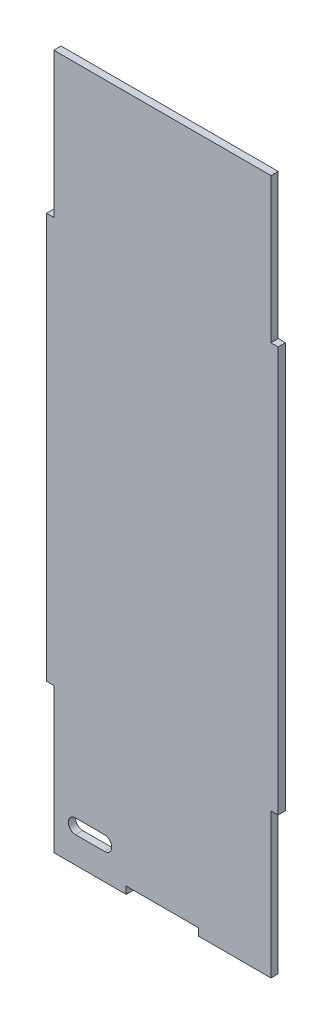
ISO-10303-21;
HEADER;
FILE_DESCRIPTION(('STEP AP214'),'2;1');
FILE_NAME('part.step','',(''),(''),'','','');
FILE_SCHEMA(('AUTOMOTIVE_DESIGN { 1 0 10303 214 1 1 1 1 }'));
ENDSEC;
DATA;
#1=APPLICATION_CONTEXT('core data for automotive mechanical design processes');
#2=APPLICATION_PROTOCOL_DEFINITION('international standard','automotive_design',2000,#1);
#3=PRODUCT_CONTEXT('',#1,'mechanical');
#4=PRODUCT('Part','Part','',(#3));
#5=PRODUCT_RELATED_PRODUCT_CATEGORY('part','',(#4));
#6=PRODUCT_DEFINITION_FORMATION('','',#4);
#7=PRODUCT_DEFINITION_CONTEXT('part definition',#1,'design');
#8=PRODUCT_DEFINITION('design','',#6,#7);
#9=PRODUCT_DEFINITION_SHAPE('','',#8);
#10=(LENGTH_UNIT() NAMED_UNIT(*) SI_UNIT(.MILLI.,.METRE.));
#11=(NAMED_UNIT(*) PLANE_ANGLE_UNIT() SI_UNIT($,.RADIAN.));
#12=(NAMED_UNIT(*) SI_UNIT($,.STERADIAN.) SOLID_ANGLE_UNIT());
#13=UNCERTAINTY_MEASURE_WITH_UNIT(LENGTH_MEASURE(1.E-05),#10,'distance_accuracy_value','');
#14=(GEOMETRIC_REPRESENTATION_CONTEXT(3) GLOBAL_UNCERTAINTY_ASSIGNED_CONTEXT((#13)) GLOBAL_UNIT_ASSIGNED_CONTEXT((#10,
#11,#12)) REPRESENTATION_CONTEXT('',''));
#15=CARTESIAN_POINT('',(0.,0.,0.));
#16=DIRECTION('',(0.,0.,1.));
#17=DIRECTION('',(1.,0.,0.));
#18=AXIS2_PLACEMENT_3D('',#15,#16,#17);
#19=CARTESIAN_POINT('',(0.,0.,6.35));
#20=DIRECTION('',(0.,0.,1.));
#21=DIRECTION('',(1.,0.,0.));
#22=AXIS2_PLACEMENT_3D('',#19,#20,#21);
#23=PLANE('',#22);
#24=CARTESIAN_POINT('',(-165.095373919362,29.4853277229758,6.35));
#25=DIRECTION('',(0.,0.,1.));
#26=DIRECTION('',(1.,0.,0.));
#27=AXIS2_PLACEMENT_3D('',#24,#25,#26);
#28=CIRCLE('',#27,6.35);
#29=CARTESIAN_POINT('',(-165.095373919362,23.1353277229758,6.35));
#30=VERTEX_POINT('',#29);
#31=CARTESIAN_POINT('',(-165.095373919362,35.8353277229758,6.35));
#32=VERTEX_POINT('',#31);
#33=EDGE_CURVE('E241',#30,#32,#28,.T.);
#34=ORIENTED_EDGE('',*,*,#33,.F.);
#35=DIRECTION('',(1.,0.,0.));
#36=VECTOR('',#35,1.);
#37=CARTESIAN_POINT('',(-165.095373919362,23.1353277229758,6.35));
#38=LINE('',#37,#36);
#39=CARTESIAN_POINT('',(-190.495373919362,23.1353277229758,6.35));
#40=VERTEX_POINT('',#39);
#41=EDGE_CURVE('E231',#40,#30,#38,.T.);
#42=ORIENTED_EDGE('',*,*,#41,.F.);
#43=CARTESIAN_POINT('',(-190.495373919362,29.4853277229758,6.35));
#44=DIRECTION('',(0.,0.,1.));
#45=DIRECTION('',(1.,0.,0.));
#46=AXIS2_PLACEMENT_3D('',#43,#44,#45);
#47=CIRCLE('',#46,6.35);
#48=CARTESIAN_POINT('',(-190.495373919362,35.8353277229758,6.35));
#49=VERTEX_POINT('',#48);
#50=EDGE_CURVE('E235',#49,#40,#47,.T.);
#51=ORIENTED_EDGE('',*,*,#50,.F.);
#52=DIRECTION('',(-1.,0.,0.));
#53=VECTOR('',#52,1.);
#54=CARTESIAN_POINT('',(-165.095373919362,35.8353277229758,6.35));
#55=LINE('',#54,#53);
#56=EDGE_CURVE('E238',#32,#49,#55,.T.);
#57=ORIENTED_EDGE('',*,*,#56,.F.);
#58=EDGE_LOOP('',(#34,#42,#51,#57));
#59=FACE_BOUND('',#58,.T.);
#60=DIRECTION('',(1.,0.,0.));
#61=VECTOR('',#60,1.);
#62=CARTESIAN_POINT('',(0.,6.34999999999999,6.35));
#63=LINE('',#62,#61);
#64=CARTESIAN_POINT('',(-146.05,6.35,6.35));
#65=VERTEX_POINT('',#64);
#66=CARTESIAN_POINT('',(-82.55,6.35,6.35));
#67=VERTEX_POINT('',#66);
#68=EDGE_CURVE('E48',#65,#67,#63,.T.);
#69=ORIENTED_EDGE('',*,*,#68,.T.);
#70=DIRECTION('',(0.,-1.,0.));
#71=VECTOR('',#70,1.);
#72=CARTESIAN_POINT('',(-82.55,-1.80411241501588E-13,6.35));
#73=LINE('',#72,#71);
#74=CARTESIAN_POINT('',(-82.55,0.,6.35));
#75=VERTEX_POINT('',#74);
#76=EDGE_CURVE('E313',#67,#75,#73,.T.);
#77=ORIENTED_EDGE('',*,*,#76,.T.);
#78=DIRECTION('',(1.,0.,0.));
#79=VECTOR('',#78,1.);
#80=CARTESIAN_POINT('',(0.,0.,6.35));
#81=LINE('',#80,#79);
#82=CARTESIAN_POINT('',(-19.05,0.,6.34999999999997));
#83=VERTEX_POINT('',#82);
#84=EDGE_CURVE('E219',#75,#83,#81,.T.);
#85=ORIENTED_EDGE('',*,*,#84,.T.);
#86=DIRECTION('',(0.,-1.,0.));
#87=VECTOR('',#86,1.);
#88=CARTESIAN_POINT('',(-19.05,0.,6.35));
#89=LINE('',#88,#87);
#90=CARTESIAN_POINT('',(-19.05,127.,6.34999999999997));
#91=VERTEX_POINT('',#90);
#92=EDGE_CURVE('E243',#91,#83,#89,.T.);
#93=ORIENTED_EDGE('',*,*,#92,.F.);
#94=DIRECTION('',(-1.,0.,0.));
#95=VECTOR('',#94,1.);
#96=CARTESIAN_POINT('',(0.,127.,6.35));
#97=LINE('',#96,#95);
#98=CARTESIAN_POINT('',(-12.7,127.,6.35000000000019));
#99=VERTEX_POINT('',#98);
#100=EDGE_CURVE('E256',#99,#91,#97,.T.);
#101=ORIENTED_EDGE('',*,*,#100,.F.);
#102=DIRECTION('',(0.,1.,0.));
#103=VECTOR('',#102,1.);
#104=CARTESIAN_POINT('',(-12.7,0.,6.35));
#105=LINE('',#104,#103);
#106=CARTESIAN_POINT('',(-12.7,482.6,6.35000000000041));
#107=VERTEX_POINT('',#106);
#108=EDGE_CURVE('E273',#99,#107,#105,.T.);
#109=ORIENTED_EDGE('',*,*,#108,.T.);
#110=DIRECTION('',(-1.,0.,0.));
#111=VECTOR('',#110,1.);
#112=CARTESIAN_POINT('',(0.,482.6,6.35));
#113=LINE('',#112,#111);
#114=CARTESIAN_POINT('',(-19.05,482.6,6.35));
#115=VERTEX_POINT('',#114);
#116=EDGE_CURVE('E266',#107,#115,#113,.T.);
#117=ORIENTED_EDGE('',*,*,#116,.T.);
#118=DIRECTION('',(0.,1.,0.));
#119=VECTOR('',#118,1.);
#120=CARTESIAN_POINT('',(-19.0499999999999,0.,6.35));
#121=LINE('',#120,#119);
#122=CARTESIAN_POINT('',(-19.05,609.6,6.35));
#123=VERTEX_POINT('',#122);
#124=EDGE_CURVE('E264',#115,#123,#121,.T.);
#125=ORIENTED_EDGE('',*,*,#124,.T.);
#126=DIRECTION('',(-1.,0.,0.));
#127=VECTOR('',#126,1.);
#128=CARTESIAN_POINT('',(0.,609.6,6.35));
#129=LINE('',#128,#127);
#130=CARTESIAN_POINT('',(-209.55,609.6,6.35));
#131=VERTEX_POINT('',#130);
#132=EDGE_CURVE('E178',#123,#131,#129,.T.);
#133=ORIENTED_EDGE('',*,*,#132,.T.);
#134=DIRECTION('',(0.,1.,0.));
#135=VECTOR('',#134,1.);
#136=CARTESIAN_POINT('',(-209.55,0.,6.35));
#137=LINE('',#136,#135);
#138=CARTESIAN_POINT('',(-209.55,482.6,6.34999999999997));
#139=VERTEX_POINT('',#138);
#140=EDGE_CURVE('E296',#139,#131,#137,.T.);
#141=ORIENTED_EDGE('',*,*,#140,.F.);
#142=DIRECTION('',(1.,0.,0.));
#143=VECTOR('',#142,1.);
#144=CARTESIAN_POINT('',(0.,482.6,6.35));
#145=LINE('',#144,#143);
#146=CARTESIAN_POINT('',(-215.9,482.6,6.35));
#147=VERTEX_POINT('',#146);
#148=EDGE_CURVE('E292',#147,#139,#145,.T.);
#149=ORIENTED_EDGE('',*,*,#148,.F.);
#150=DIRECTION('',(0.,1.,0.));
#151=VECTOR('',#150,1.);
#152=CARTESIAN_POINT('',(-215.9,0.,6.35));
#153=LINE('',#152,#151);
#154=CARTESIAN_POINT('',(-215.9,127.,6.35000000000019));
#155=VERTEX_POINT('',#154);
#156=EDGE_CURVE('E304',#155,#147,#153,.T.);
#157=ORIENTED_EDGE('',*,*,#156,.F.);
#158=DIRECTION('',(1.,0.,0.));
#159=VECTOR('',#158,1.);
#160=CARTESIAN_POINT('',(3.70074341541717E-13,126.999999999999,6.35));
#161=LINE('',#160,#159);
#162=CARTESIAN_POINT('',(-209.55,127.,6.35));
#163=VERTEX_POINT('',#162);
#164=EDGE_CURVE('E280',#155,#163,#161,.T.);
#165=ORIENTED_EDGE('',*,*,#164,.T.);
#166=DIRECTION('',(0.,-1.,0.));
#167=VECTOR('',#166,1.);
#168=CARTESIAN_POINT('',(-209.55,0.,6.35));
#169=LINE('',#168,#167);
#170=CARTESIAN_POINT('',(-209.55,0.,6.35000000000019));
#171=VERTEX_POINT('',#170);
#172=EDGE_CURVE('E284',#163,#171,#169,.T.);
#173=ORIENTED_EDGE('',*,*,#172,.T.);
#174=CARTESIAN_POINT('',(-146.05,0.,6.35));
#175=VERTEX_POINT('',#174);
#176=EDGE_CURVE('E212',#171,#175,#81,.T.);
#177=ORIENTED_EDGE('',*,*,#176,.T.);
#178=DIRECTION('',(0.,1.,0.));
#179=VECTOR('',#178,1.);
#180=CARTESIAN_POINT('',(-146.05,0.,6.35));
#181=LINE('',#180,#179);
#182=EDGE_CURVE('E53',#175,#65,#181,.T.);
#183=ORIENTED_EDGE('',*,*,#182,.T.);
#184=EDGE_LOOP('',(#69,#77,#85,#93,#101,#109,#117,#125,#133,#141,#149,#157,#165,#173,#177,#183));
#185=FACE_BOUND('',#184,.T.);
#186=ADVANCED_FACE('F33',(#59,#185),#23,.T.);
#187=CARTESIAN_POINT('',(0.,0.,0.));
#188=DIRECTION('',(0.,0.,1.));
#189=DIRECTION('',(1.,0.,0.));
#190=AXIS2_PLACEMENT_3D('',#187,#188,#189);
#191=PLANE('',#190);
#192=DIRECTION('',(1.,0.,0.));
#193=VECTOR('',#192,1.);
#194=CARTESIAN_POINT('',(-165.095373919362,23.1353277229758,0.));
#195=LINE('',#194,#193);
#196=CARTESIAN_POINT('',(-190.495373919362,23.1353277229758,0.));
#197=VERTEX_POINT('',#196);
#198=CARTESIAN_POINT('',(-165.095373919362,23.1353277229758,0.));
#199=VERTEX_POINT('',#198);
#200=EDGE_CURVE('E226',#197,#199,#195,.T.);
#201=ORIENTED_EDGE('',*,*,#200,.T.);
#202=CARTESIAN_POINT('',(-165.095373919362,29.4853277229758,0.));
#203=DIRECTION('',(0.,0.,1.));
#204=DIRECTION('',(1.,0.,0.));
#205=AXIS2_PLACEMENT_3D('',#202,#203,#204);
#206=CIRCLE('',#205,6.35);
#207=CARTESIAN_POINT('',(-165.095373919362,35.8353277229758,0.));
#208=VERTEX_POINT('',#207);
#209=EDGE_CURVE('E234',#199,#208,#206,.T.);
#210=ORIENTED_EDGE('',*,*,#209,.T.);
#211=DIRECTION('',(-1.,0.,0.));
#212=VECTOR('',#211,1.);
#213=CARTESIAN_POINT('',(-165.095373919362,35.8353277229758,0.));
#214=LINE('',#213,#212);
#215=CARTESIAN_POINT('',(-190.495373919362,35.8353277229758,0.));
#216=VERTEX_POINT('',#215);
#217=EDGE_CURVE('E249',#208,#216,#214,.T.);
#218=ORIENTED_EDGE('',*,*,#217,.T.);
#219=CARTESIAN_POINT('',(-190.495373919362,29.4853277229758,0.));
#220=DIRECTION('',(0.,0.,1.));
#221=DIRECTION('',(1.,0.,0.));
#222=AXIS2_PLACEMENT_3D('',#219,#220,#221);
#223=CIRCLE('',#222,6.35);
#224=EDGE_CURVE('E246',#216,#197,#223,.T.);
#225=ORIENTED_EDGE('',*,*,#224,.T.);
#226=EDGE_LOOP('',(#201,#210,#218,#225));
#227=FACE_BOUND('',#226,.T.);
#228=DIRECTION('',(0.,-1.,0.));
#229=VECTOR('',#228,1.);
#230=CARTESIAN_POINT('',(-82.55,-1.80411241501588E-13,0.));
#231=LINE('',#230,#229);
#232=CARTESIAN_POINT('',(-82.55,6.35,0.));
#233=VERTEX_POINT('',#232);
#234=CARTESIAN_POINT('',(-82.55,0.,0.));
#235=VERTEX_POINT('',#234);
#236=EDGE_CURVE('E315',#233,#235,#231,.T.);
#237=ORIENTED_EDGE('',*,*,#236,.F.);
#238=DIRECTION('',(1.,0.,0.));
#239=VECTOR('',#238,1.);
#240=CARTESIAN_POINT('',(0.,6.34999999999999,0.));
#241=LINE('',#240,#239);
#242=CARTESIAN_POINT('',(-146.05,6.35,0.));
#243=VERTEX_POINT('',#242);
#244=EDGE_CURVE('E11',#243,#233,#241,.T.);
#245=ORIENTED_EDGE('',*,*,#244,.F.);
#246=DIRECTION('',(0.,1.,0.));
#247=VECTOR('',#246,1.);
#248=CARTESIAN_POINT('',(-146.05,0.,0.));
#249=LINE('',#248,#247);
#250=CARTESIAN_POINT('',(-146.05,0.,0.));
#251=VERTEX_POINT('',#250);
#252=EDGE_CURVE('E182',#251,#243,#249,.T.);
#253=ORIENTED_EDGE('',*,*,#252,.F.);
#254=DIRECTION('',(1.,0.,0.));
#255=VECTOR('',#254,1.);
#256=CARTESIAN_POINT('',(0.,0.,0.));
#257=LINE('',#256,#255);
#258=CARTESIAN_POINT('',(-209.55,0.,0.));
#259=VERTEX_POINT('',#258);
#260=EDGE_CURVE('E168',#259,#251,#257,.T.);
#261=ORIENTED_EDGE('',*,*,#260,.F.);
#262=DIRECTION('',(0.,-1.,0.));
#263=VECTOR('',#262,1.);
#264=CARTESIAN_POINT('',(-209.55,0.,0.));
#265=LINE('',#264,#263);
#266=CARTESIAN_POINT('',(-209.55,127.,0.));
#267=VERTEX_POINT('',#266);
#268=EDGE_CURVE('E287',#267,#259,#265,.T.);
#269=ORIENTED_EDGE('',*,*,#268,.F.);
#270=DIRECTION('',(1.,0.,0.));
#271=VECTOR('',#270,1.);
#272=CARTESIAN_POINT('',(3.70074341541717E-13,126.999999999999,0.));
#273=LINE('',#272,#271);
#274=CARTESIAN_POINT('',(-215.9,127.,2.22044604925031E-13));
#275=VERTEX_POINT('',#274);
#276=EDGE_CURVE('E282',#275,#267,#273,.T.);
#277=ORIENTED_EDGE('',*,*,#276,.F.);
#278=DIRECTION('',(0.,1.,0.));
#279=VECTOR('',#278,1.);
#280=CARTESIAN_POINT('',(-215.9,0.,0.));
#281=LINE('',#280,#279);
#282=CARTESIAN_POINT('',(-215.9,482.6,0.));
#283=VERTEX_POINT('',#282);
#284=EDGE_CURVE('E306',#275,#283,#281,.T.);
#285=ORIENTED_EDGE('',*,*,#284,.T.);
#286=DIRECTION('',(1.,0.,0.));
#287=VECTOR('',#286,1.);
#288=CARTESIAN_POINT('',(0.,482.6,0.));
#289=LINE('',#288,#287);
#290=CARTESIAN_POINT('',(-209.55,482.6,0.));
#291=VERTEX_POINT('',#290);
#292=EDGE_CURVE('E294',#283,#291,#289,.T.);
#293=ORIENTED_EDGE('',*,*,#292,.T.);
#294=DIRECTION('',(0.,1.,0.));
#295=VECTOR('',#294,1.);
#296=CARTESIAN_POINT('',(-209.55,0.,0.));
#297=LINE('',#296,#295);
#298=CARTESIAN_POINT('',(-209.55,609.6,0.));
#299=VERTEX_POINT('',#298);
#300=EDGE_CURVE('E298',#291,#299,#297,.T.);
#301=ORIENTED_EDGE('',*,*,#300,.T.);
#302=DIRECTION('',(-1.,0.,0.));
#303=VECTOR('',#302,1.);
#304=CARTESIAN_POINT('',(0.,609.6,0.));
#305=LINE('',#304,#303);
#306=CARTESIAN_POINT('',(-19.05,609.6,0.));
#307=VERTEX_POINT('',#306);
#308=EDGE_CURVE('E214',#307,#299,#305,.T.);
#309=ORIENTED_EDGE('',*,*,#308,.F.);
#310=DIRECTION('',(0.,1.,0.));
#311=VECTOR('',#310,1.);
#312=CARTESIAN_POINT('',(-19.0499999999999,0.,0.));
#313=LINE('',#312,#311);
#314=CARTESIAN_POINT('',(-19.05,482.6,2.22044604925031E-13));
#315=VERTEX_POINT('',#314);
#316=EDGE_CURVE('E203',#315,#307,#313,.T.);
#317=ORIENTED_EDGE('',*,*,#316,.F.);
#318=DIRECTION('',(-1.,0.,0.));
#319=VECTOR('',#318,1.);
#320=CARTESIAN_POINT('',(0.,482.6,0.));
#321=LINE('',#320,#319);
#322=CARTESIAN_POINT('',(-12.7,482.6,0.));
#323=VERTEX_POINT('',#322);
#324=EDGE_CURVE('E206',#323,#315,#321,.T.);
#325=ORIENTED_EDGE('',*,*,#324,.F.);
#326=DIRECTION('',(0.,1.,0.));
#327=VECTOR('',#326,1.);
#328=CARTESIAN_POINT('',(-12.7,0.,0.));
#329=LINE('',#328,#327);
#330=CARTESIAN_POINT('',(-12.7,127.,2.22044604925031E-13));
#331=VERTEX_POINT('',#330);
#332=EDGE_CURVE('E276',#331,#323,#329,.T.);
#333=ORIENTED_EDGE('',*,*,#332,.F.);
#334=DIRECTION('',(-1.,0.,0.));
#335=VECTOR('',#334,1.);
#336=CARTESIAN_POINT('',(0.,127.,0.));
#337=LINE('',#336,#335);
#338=CARTESIAN_POINT('',(-19.05,127.,0.));
#339=VERTEX_POINT('',#338);
#340=EDGE_CURVE('E211',#331,#339,#337,.T.);
#341=ORIENTED_EDGE('',*,*,#340,.T.);
#342=DIRECTION('',(0.,-1.,0.));
#343=VECTOR('',#342,1.);
#344=CARTESIAN_POINT('',(-19.05,0.,0.));
#345=LINE('',#344,#343);
#346=CARTESIAN_POINT('',(-19.05,0.,0.));
#347=VERTEX_POINT('',#346);
#348=EDGE_CURVE('E208',#339,#347,#345,.T.);
#349=ORIENTED_EDGE('',*,*,#348,.T.);
#350=EDGE_CURVE('E179',#235,#347,#257,.T.);
#351=ORIENTED_EDGE('',*,*,#350,.F.);
#352=EDGE_LOOP('',(#237,#245,#253,#261,#269,#277,#285,#293,#301,#309,#317,#325,#333,#341,#349,#351));
#353=FACE_BOUND('',#352,.T.);
#354=ADVANCED_FACE('F183',(#227,#353),#191,.F.);
#355=CARTESIAN_POINT('',(0.,0.,6.35));
#356=DIRECTION('',(0.,1.,0.));
#357=DIRECTION('',(0.,0.,1.));
#358=AXIS2_PLACEMENT_3D('',#355,#356,#357);
#359=PLANE('',#358);
#360=DIRECTION('',(0.,0.,1.));
#361=VECTOR('',#360,1.);
#362=CARTESIAN_POINT('',(-82.55,0.,6.35));
#363=LINE('',#362,#361);
#364=EDGE_CURVE('E41',#235,#75,#363,.T.);
#365=ORIENTED_EDGE('',*,*,#364,.F.);
#366=ORIENTED_EDGE('',*,*,#350,.T.);
#367=DIRECTION('',(0.,0.,-1.));
#368=VECTOR('',#367,1.);
#369=CARTESIAN_POINT('',(-19.05,0.,828.142564742028));
#370=LINE('',#369,#368);
#371=EDGE_CURVE('E258',#83,#347,#370,.T.);
#372=ORIENTED_EDGE('',*,*,#371,.F.);
#373=ORIENTED_EDGE('',*,*,#84,.F.);
#374=EDGE_LOOP('',(#365,#366,#372,#373));
#375=FACE_BOUND('',#374,.T.);
#376=ADVANCED_FACE('F331',(#375),#359,.F.);
#377=DIRECTION('',(0.,0.,-1.));
#378=VECTOR('',#377,1.);
#379=CARTESIAN_POINT('',(-146.05,0.,6.35));
#380=LINE('',#379,#378);
#381=EDGE_CURVE('E172',#175,#251,#380,.T.);
#382=ORIENTED_EDGE('',*,*,#381,.F.);
#383=ORIENTED_EDGE('',*,*,#176,.F.);
#384=DIRECTION('',(0.,0.,1.));
#385=VECTOR('',#384,1.);
#386=CARTESIAN_POINT('',(-209.55,0.,6.35));
#387=LINE('',#386,#385);
#388=EDGE_CURVE('E174',#259,#171,#387,.T.);
#389=ORIENTED_EDGE('',*,*,#388,.F.);
#390=ORIENTED_EDGE('',*,*,#260,.T.);
#391=EDGE_LOOP('',(#382,#383,#389,#390));
#392=FACE_BOUND('',#391,.T.);
#393=ADVANCED_FACE('F170',(#392),#359,.F.);
#394=CARTESIAN_POINT('',(-19.05,127.,828.142564742028));
#395=DIRECTION('',(0.,1.,0.));
#396=DIRECTION('',(0.,0.,1.));
#397=AXIS2_PLACEMENT_3D('',#394,#395,#396);
#398=PLANE('',#397);
#399=DIRECTION('',(0.,0.,-1.));
#400=VECTOR('',#399,1.);
#401=CARTESIAN_POINT('',(-12.7,127.,820.205064742028));
#402=LINE('',#401,#400);
#403=EDGE_CURVE('E278',#99,#331,#402,.T.);
#404=ORIENTED_EDGE('',*,*,#403,.F.);
#405=ORIENTED_EDGE('',*,*,#100,.T.);
#406=DIRECTION('',(0.,0.,-1.));
#407=VECTOR('',#406,1.);
#408=CARTESIAN_POINT('',(-19.05,127.,828.142564742028));
#409=LINE('',#408,#407);
#410=EDGE_CURVE('E261',#91,#339,#409,.T.);
#411=ORIENTED_EDGE('',*,*,#410,.T.);
#412=ORIENTED_EDGE('',*,*,#340,.F.);
#413=EDGE_LOOP('',(#404,#405,#411,#412));
#414=FACE_BOUND('',#413,.T.);
#415=ADVANCED_FACE('F342',(#414),#398,.F.);
#416=CARTESIAN_POINT('',(-19.05,482.6,820.205064742028));
#417=DIRECTION('',(0.,1.,0.));
#418=DIRECTION('',(0.,0.,1.));
#419=AXIS2_PLACEMENT_3D('',#416,#417,#418);
#420=PLANE('',#419);
#421=ORIENTED_EDGE('',*,*,#116,.F.);
#422=DIRECTION('',(0.,0.,-1.));
#423=VECTOR('',#422,1.);
#424=CARTESIAN_POINT('',(-12.7,482.6,820.205064742028));
#425=LINE('',#424,#423);
#426=EDGE_CURVE('E200',#107,#323,#425,.T.);
#427=ORIENTED_EDGE('',*,*,#426,.T.);
#428=ORIENTED_EDGE('',*,*,#324,.T.);
#429=DIRECTION('',(0.,0.,-1.));
#430=VECTOR('',#429,1.);
#431=CARTESIAN_POINT('',(-19.05,482.6,820.205064742028));
#432=LINE('',#431,#430);
#433=EDGE_CURVE('E270',#115,#315,#432,.T.);
#434=ORIENTED_EDGE('',*,*,#433,.F.);
#435=EDGE_LOOP('',(#421,#427,#428,#434));
#436=FACE_BOUND('',#435,.T.);
#437=ADVANCED_FACE('F349',(#436),#420,.T.);
#438=CARTESIAN_POINT('',(0.,609.6,6.35));
#439=DIRECTION('',(0.,-1.,0.));
#440=DIRECTION('',(0.,0.,-1.));
#441=AXIS2_PLACEMENT_3D('',#438,#439,#440);
#442=PLANE('',#441);
#443=ORIENTED_EDGE('',*,*,#308,.T.);
#444=DIRECTION('',(0.,0.,1.));
#445=VECTOR('',#444,1.);
#446=CARTESIAN_POINT('',(-209.55,609.6,6.35));
#447=LINE('',#446,#445);
#448=EDGE_CURVE('E194',#299,#131,#447,.T.);
#449=ORIENTED_EDGE('',*,*,#448,.T.);
#450=ORIENTED_EDGE('',*,*,#132,.F.);
#451=DIRECTION('',(0.,0.,-1.));
#452=VECTOR('',#451,1.);
#453=CARTESIAN_POINT('',(-19.05,609.6,820.205064742028));
#454=LINE('',#453,#452);
#455=EDGE_CURVE('E268',#123,#307,#454,.T.);
#456=ORIENTED_EDGE('',*,*,#455,.T.);
#457=EDGE_LOOP('',(#443,#449,#450,#456));
#458=FACE_BOUND('',#457,.T.);
#459=ADVANCED_FACE('F35',(#458),#442,.F.);
#460=CARTESIAN_POINT('',(-165.095373919362,29.4853277229758,0.));
#461=DIRECTION('',(0.,0.,1.));
#462=DIRECTION('',(1.,0.,0.));
#463=AXIS2_PLACEMENT_3D('',#460,#461,#462);
#464=CYLINDRICAL_SURFACE('',#463,6.35);
#465=ORIENTED_EDGE('',*,*,#33,.T.);
#466=DIRECTION('',(0.,0.,1.));
#467=VECTOR('',#466,1.);
#468=CARTESIAN_POINT('',(-165.095373919362,35.8353277229758,0.));
#469=LINE('',#468,#467);
#470=EDGE_CURVE('E222',#208,#32,#469,.T.);
#471=ORIENTED_EDGE('',*,*,#470,.F.);
#472=ORIENTED_EDGE('',*,*,#209,.F.);
#473=DIRECTION('',(0.,0.,1.));
#474=VECTOR('',#473,1.);
#475=CARTESIAN_POINT('',(-165.095373919362,23.1353277229758,0.));
#476=LINE('',#475,#474);
#477=EDGE_CURVE('E217',#199,#30,#476,.T.);
#478=ORIENTED_EDGE('',*,*,#477,.T.);
#479=EDGE_LOOP('',(#465,#471,#472,#478));
#480=FACE_BOUND('',#479,.T.);
#481=ADVANCED_FACE('F396',(#480),#464,.F.);
#482=CARTESIAN_POINT('',(-165.095373919362,23.1353277229758,0.));
#483=DIRECTION('',(0.,-1.,0.));
#484=DIRECTION('',(0.,0.,-1.));
#485=AXIS2_PLACEMENT_3D('',#482,#483,#484);
#486=PLANE('',#485);
#487=ORIENTED_EDGE('',*,*,#41,.T.);
#488=ORIENTED_EDGE('',*,*,#477,.F.);
#489=ORIENTED_EDGE('',*,*,#200,.F.);
#490=DIRECTION('',(0.,0.,1.));
#491=VECTOR('',#490,1.);
#492=CARTESIAN_POINT('',(-190.495373919362,23.1353277229758,0.));
#493=LINE('',#492,#491);
#494=EDGE_CURVE('E228',#197,#40,#493,.T.);
#495=ORIENTED_EDGE('',*,*,#494,.T.);
#496=EDGE_LOOP('',(#487,#488,#489,#495));
#497=FACE_BOUND('',#496,.T.);
#498=ADVANCED_FACE('F415',(#497),#486,.F.);
#499=CARTESIAN_POINT('',(-190.495373919362,29.4853277229758,0.));
#500=DIRECTION('',(0.,0.,1.));
#501=DIRECTION('',(1.,0.,0.));
#502=AXIS2_PLACEMENT_3D('',#499,#500,#501);
#503=CYLINDRICAL_SURFACE('',#502,6.35);
#504=ORIENTED_EDGE('',*,*,#50,.T.);
#505=ORIENTED_EDGE('',*,*,#494,.F.);
#506=ORIENTED_EDGE('',*,*,#224,.F.);
#507=DIRECTION('',(0.,0.,1.));
#508=VECTOR('',#507,1.);
#509=CARTESIAN_POINT('',(-190.495373919362,35.8353277229758,0.));
#510=LINE('',#509,#508);
#511=EDGE_CURVE('E225',#216,#49,#510,.T.);
#512=ORIENTED_EDGE('',*,*,#511,.T.);
#513=EDGE_LOOP('',(#504,#505,#506,#512));
#514=FACE_BOUND('',#513,.T.);
#515=ADVANCED_FACE('F418',(#514),#503,.F.);
#516=CARTESIAN_POINT('',(-165.095373919362,35.8353277229758,0.));
#517=DIRECTION('',(0.,1.,0.));
#518=DIRECTION('',(0.,0.,1.));
#519=AXIS2_PLACEMENT_3D('',#516,#517,#518);
#520=PLANE('',#519);
#521=ORIENTED_EDGE('',*,*,#56,.T.);
#522=ORIENTED_EDGE('',*,*,#511,.F.);
#523=ORIENTED_EDGE('',*,*,#217,.F.);
#524=ORIENTED_EDGE('',*,*,#470,.T.);
#525=EDGE_LOOP('',(#521,#522,#523,#524));
#526=FACE_BOUND('',#525,.T.);
#527=ADVANCED_FACE('F414',(#526),#520,.F.);
#528=CARTESIAN_POINT('',(-19.05,0.,828.142564742028));
#529=DIRECTION('',(-1.,0.,0.));
#530=DIRECTION('',(0.,-1.,0.));
#531=AXIS2_PLACEMENT_3D('',#528,#529,#530);
#532=PLANE('',#531);
#533=ORIENTED_EDGE('',*,*,#410,.F.);
#534=ORIENTED_EDGE('',*,*,#92,.T.);
#535=ORIENTED_EDGE('',*,*,#371,.T.);
#536=ORIENTED_EDGE('',*,*,#348,.F.);
#537=EDGE_LOOP('',(#533,#534,#535,#536));
#538=FACE_BOUND('',#537,.T.);
#539=ADVANCED_FACE('F336',(#538),#532,.F.);
#540=CARTESIAN_POINT('',(-19.05,609.6,820.205064742028));
#541=DIRECTION('',(1.,0.,0.));
#542=DIRECTION('',(0.,1.,0.));
#543=AXIS2_PLACEMENT_3D('',#540,#541,#542);
#544=PLANE('',#543);
#545=ORIENTED_EDGE('',*,*,#124,.F.);
#546=ORIENTED_EDGE('',*,*,#433,.T.);
#547=ORIENTED_EDGE('',*,*,#316,.T.);
#548=ORIENTED_EDGE('',*,*,#455,.F.);
#549=EDGE_LOOP('',(#545,#546,#547,#548));
#550=FACE_BOUND('',#549,.T.);
#551=ADVANCED_FACE('F352',(#550),#544,.T.);
#552=CARTESIAN_POINT('',(-12.7,482.6,820.205064742028));
#553=DIRECTION('',(1.,0.,0.));
#554=DIRECTION('',(0.,0.,-1.));
#555=AXIS2_PLACEMENT_3D('',#552,#553,#554);
#556=PLANE('',#555);
#557=ORIENTED_EDGE('',*,*,#108,.F.);
#558=ORIENTED_EDGE('',*,*,#403,.T.);
#559=ORIENTED_EDGE('',*,*,#332,.T.);
#560=ORIENTED_EDGE('',*,*,#426,.F.);
#561=EDGE_LOOP('',(#557,#558,#559,#560));
#562=FACE_BOUND('',#561,.T.);
#563=ADVANCED_FACE('F383',(#562),#556,.T.);
#564=CARTESIAN_POINT('',(-209.55,127.,814.767911436437));
#565=DIRECTION('',(0.,-1.,0.));
#566=DIRECTION('',(1.,0.,0.));
#567=AXIS2_PLACEMENT_3D('',#564,#565,#566);
#568=PLANE('',#567);
#569=DIRECTION('',(0.,0.,-1.));
#570=VECTOR('',#569,1.);
#571=CARTESIAN_POINT('',(-215.9,127.,814.767911436436));
#572=LINE('',#571,#570);
#573=EDGE_CURVE('E309',#155,#275,#572,.T.);
#574=ORIENTED_EDGE('',*,*,#573,.T.);
#575=ORIENTED_EDGE('',*,*,#276,.T.);
#576=DIRECTION('',(0.,0.,-1.));
#577=VECTOR('',#576,1.);
#578=CARTESIAN_POINT('',(-209.55,127.,814.767911436437));
#579=LINE('',#578,#577);
#580=EDGE_CURVE('E289',#163,#267,#579,.T.);
#581=ORIENTED_EDGE('',*,*,#580,.F.);
#582=ORIENTED_EDGE('',*,*,#164,.F.);
#583=EDGE_LOOP('',(#574,#575,#581,#582));
#584=FACE_BOUND('',#583,.T.);
#585=ADVANCED_FACE('F373',(#584),#568,.T.);
#586=CARTESIAN_POINT('',(-209.55,0.,814.767911436437));
#587=DIRECTION('',(-1.,0.,0.));
#588=DIRECTION('',(0.,0.,1.));
#589=AXIS2_PLACEMENT_3D('',#586,#587,#588);
#590=PLANE('',#589);
#591=ORIENTED_EDGE('',*,*,#172,.F.);
#592=ORIENTED_EDGE('',*,*,#580,.T.);
#593=ORIENTED_EDGE('',*,*,#268,.T.);
#594=ORIENTED_EDGE('',*,*,#388,.T.);
#595=EDGE_LOOP('',(#591,#592,#593,#594));
#596=FACE_BOUND('',#595,.T.);
#597=ADVANCED_FACE('F375',(#596),#590,.T.);
#598=CARTESIAN_POINT('',(-209.55,482.6,814.767911436436));
#599=DIRECTION('',(0.,-1.,0.));
#600=DIRECTION('',(0.,0.,-1.));
#601=AXIS2_PLACEMENT_3D('',#598,#599,#600);
#602=PLANE('',#601);
#603=ORIENTED_EDGE('',*,*,#292,.F.);
#604=DIRECTION('',(0.,0.,1.));
#605=VECTOR('',#604,1.);
#606=CARTESIAN_POINT('',(-215.9,482.6,814.767911436436));
#607=LINE('',#606,#605);
#608=EDGE_CURVE('E190',#283,#147,#607,.T.);
#609=ORIENTED_EDGE('',*,*,#608,.T.);
#610=ORIENTED_EDGE('',*,*,#148,.T.);
#611=DIRECTION('',(0.,0.,-1.));
#612=VECTOR('',#611,1.);
#613=CARTESIAN_POINT('',(-209.55,482.6,814.767911436436));
#614=LINE('',#613,#612);
#615=EDGE_CURVE('E301',#139,#291,#614,.T.);
#616=ORIENTED_EDGE('',*,*,#615,.T.);
#617=EDGE_LOOP('',(#603,#609,#610,#616));
#618=FACE_BOUND('',#617,.T.);
#619=ADVANCED_FACE('F365',(#618),#602,.F.);
#620=CARTESIAN_POINT('',(-209.55,609.6,814.767911436436));
#621=DIRECTION('',(1.,0.,0.));
#622=DIRECTION('',(0.,1.,0.));
#623=AXIS2_PLACEMENT_3D('',#620,#621,#622);
#624=PLANE('',#623);
#625=ORIENTED_EDGE('',*,*,#615,.F.);
#626=ORIENTED_EDGE('',*,*,#140,.T.);
#627=ORIENTED_EDGE('',*,*,#448,.F.);
#628=ORIENTED_EDGE('',*,*,#300,.F.);
#629=EDGE_LOOP('',(#625,#626,#627,#628));
#630=FACE_BOUND('',#629,.T.);
#631=ADVANCED_FACE('F361',(#630),#624,.F.);
#632=CARTESIAN_POINT('',(-215.9,482.6,814.767911436436));
#633=DIRECTION('',(1.,0.,0.));
#634=DIRECTION('',(0.,0.,-1.));
#635=AXIS2_PLACEMENT_3D('',#632,#633,#634);
#636=PLANE('',#635);
#637=ORIENTED_EDGE('',*,*,#573,.F.);
#638=ORIENTED_EDGE('',*,*,#156,.T.);
#639=ORIENTED_EDGE('',*,*,#608,.F.);
#640=ORIENTED_EDGE('',*,*,#284,.F.);
#641=EDGE_LOOP('',(#637,#638,#639,#640));
#642=FACE_BOUND('',#641,.T.);
#643=ADVANCED_FACE('F480',(#642),#636,.F.);
#644=CARTESIAN_POINT('',(-146.05,6.35,809.607744379879));
#645=DIRECTION('',(0.,-1.,0.));
#646=DIRECTION('',(1.,0.,0.));
#647=AXIS2_PLACEMENT_3D('',#644,#645,#646);
#648=PLANE('',#647);
#649=ORIENTED_EDGE('',*,*,#68,.F.);
#650=DIRECTION('',(0.,0.,-1.));
#651=VECTOR('',#650,1.);
#652=CARTESIAN_POINT('',(-146.05,6.35,809.607744379879));
#653=LINE('',#652,#651);
#654=EDGE_CURVE('E321',#65,#243,#653,.T.);
#655=ORIENTED_EDGE('',*,*,#654,.T.);
#656=ORIENTED_EDGE('',*,*,#244,.T.);
#657=DIRECTION('',(0.,0.,-1.));
#658=VECTOR('',#657,1.);
#659=CARTESIAN_POINT('',(-82.55,6.35,809.607744379879));
#660=LINE('',#659,#658);
#661=EDGE_CURVE('E187',#67,#233,#660,.T.);
#662=ORIENTED_EDGE('',*,*,#661,.F.);
#663=EDGE_LOOP('',(#649,#655,#656,#662));
#664=FACE_BOUND('',#663,.T.);
#665=ADVANCED_FACE('F323',(#664),#648,.T.);
#666=CARTESIAN_POINT('',(-82.55,0.,809.607744379879));
#667=DIRECTION('',(-1.,0.,0.));
#668=DIRECTION('',(0.,-1.,0.));
#669=AXIS2_PLACEMENT_3D('',#666,#667,#668);
#670=PLANE('',#669);
#671=ORIENTED_EDGE('',*,*,#76,.F.);
#672=ORIENTED_EDGE('',*,*,#661,.T.);
#673=ORIENTED_EDGE('',*,*,#236,.T.);
#674=ORIENTED_EDGE('',*,*,#364,.T.);
#675=EDGE_LOOP('',(#671,#672,#673,#674));
#676=FACE_BOUND('',#675,.T.);
#677=ADVANCED_FACE('F326',(#676),#670,.T.);
#678=CARTESIAN_POINT('',(-146.05,6.35,809.607744379879));
#679=DIRECTION('',(1.,0.,0.));
#680=DIRECTION('',(0.,0.,-1.));
#681=AXIS2_PLACEMENT_3D('',#678,#679,#680);
#682=PLANE('',#681);
#683=ORIENTED_EDGE('',*,*,#182,.F.);
#684=ORIENTED_EDGE('',*,*,#381,.T.);
#685=ORIENTED_EDGE('',*,*,#252,.T.);
#686=ORIENTED_EDGE('',*,*,#654,.F.);
#687=EDGE_LOOP('',(#683,#684,#685,#686));
#688=FACE_BOUND('',#687,.T.);
#689=ADVANCED_FACE('F189',(#688),#682,.T.);
#690=CLOSED_SHELL('',(#186,#354,#376,#393,#415,#437,#459,#481,#498,#515,#527,#539,#551,#563,
#585,#597,#619,#631,#643,#665,#677,#689));
#691=MANIFOLD_SOLID_BREP('B2',#690);
#692=ADVANCED_BREP_SHAPE_REPRESENTATION('',(#18,#691),#14);
#693=SHAPE_DEFINITION_REPRESENTATION(#9,#692);
ENDSEC;
END-ISO-10303-21;
